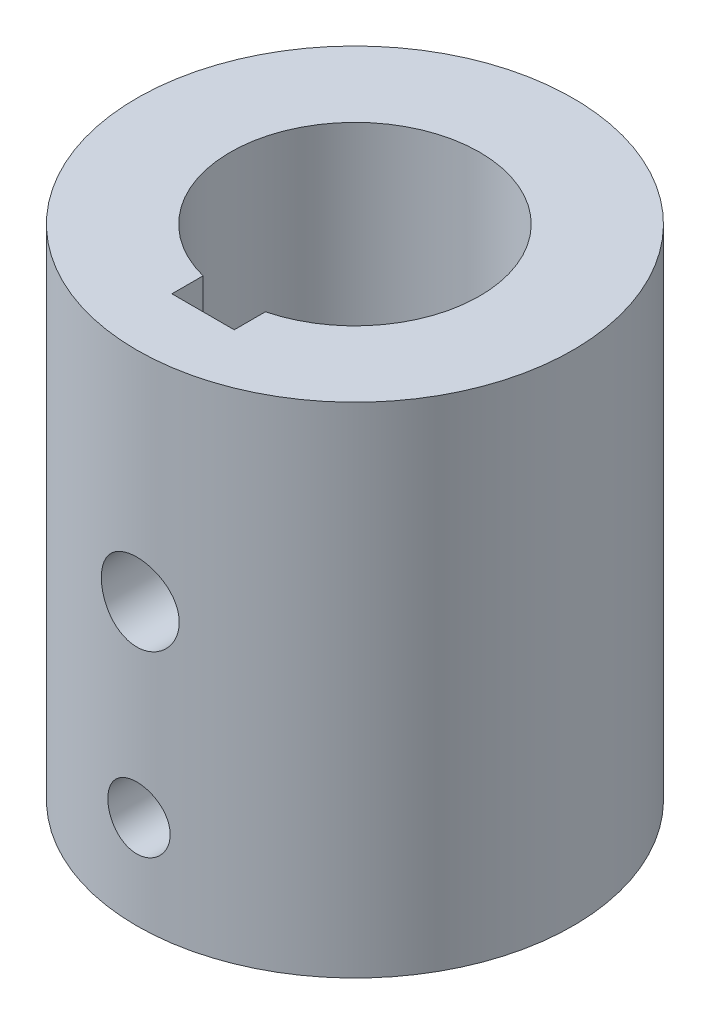
ISO-10303-21;
HEADER;
FILE_DESCRIPTION(('STEP AP214'),'2;1');
FILE_NAME('part.step','',(''),(''),'','','');
FILE_SCHEMA(('AUTOMOTIVE_DESIGN { 1 0 10303 214 1 1 1 1 }'));
ENDSEC;
DATA;
#1=APPLICATION_CONTEXT('core data for automotive mechanical design processes');
#2=APPLICATION_PROTOCOL_DEFINITION('international standard','automotive_design',2000,#1);
#3=PRODUCT_CONTEXT('',#1,'mechanical');
#4=PRODUCT('Part','Part','',(#3));
#5=PRODUCT_RELATED_PRODUCT_CATEGORY('part','',(#4));
#6=PRODUCT_DEFINITION_FORMATION('','',#4);
#7=PRODUCT_DEFINITION_CONTEXT('part definition',#1,'design');
#8=PRODUCT_DEFINITION('design','',#6,#7);
#9=PRODUCT_DEFINITION_SHAPE('','',#8);
#10=(LENGTH_UNIT() NAMED_UNIT(*) SI_UNIT(.MILLI.,.METRE.));
#11=(NAMED_UNIT(*) PLANE_ANGLE_UNIT() SI_UNIT($,.RADIAN.));
#12=(NAMED_UNIT(*) SI_UNIT($,.STERADIAN.) SOLID_ANGLE_UNIT());
#13=UNCERTAINTY_MEASURE_WITH_UNIT(LENGTH_MEASURE(1.E-05),#10,'distance_accuracy_value','');
#14=(GEOMETRIC_REPRESENTATION_CONTEXT(3) GLOBAL_UNCERTAINTY_ASSIGNED_CONTEXT((#13)) GLOBAL_UNIT_ASSIGNED_CONTEXT((#10,
#11,#12)) REPRESENTATION_CONTEXT('',''));
#15=CARTESIAN_POINT('',(0.,0.,0.));
#16=DIRECTION('',(0.,0.,1.));
#17=DIRECTION('',(1.,0.,0.));
#18=AXIS2_PLACEMENT_3D('',#15,#16,#17);
#19=CARTESIAN_POINT('',(0.,50.8,0.));
#20=DIRECTION('',(0.,1.,0.));
#21=DIRECTION('',(0.,0.,1.));
#22=AXIS2_PLACEMENT_3D('',#19,#20,#21);
#23=PLANE('',#22);
#24=DIRECTION('',(0.,0.,-1.));
#25=VECTOR('',#24,1.);
#26=CARTESIAN_POINT('',(3.175,50.8,12.2967221242086));
#27=LINE('',#26,#25);
#28=CARTESIAN_POINT('',(3.175,50.8,15.4717221242085));
#29=VERTEX_POINT('',#28);
#30=CARTESIAN_POINT('',(3.175,50.8,12.2967221242086));
#31=VERTEX_POINT('',#30);
#32=EDGE_CURVE('E106',#29,#31,#27,.T.);
#33=ORIENTED_EDGE('',*,*,#32,.F.);
#34=DIRECTION('',(1.,0.,0.));
#35=VECTOR('',#34,1.);
#36=CARTESIAN_POINT('',(3.175,50.8,15.4717221242085));
#37=LINE('',#36,#35);
#38=CARTESIAN_POINT('',(-3.175,50.8,15.4717221242085));
#39=VERTEX_POINT('',#38);
#40=EDGE_CURVE('E130',#39,#29,#37,.T.);
#41=ORIENTED_EDGE('',*,*,#40,.F.);
#42=DIRECTION('',(0.,0.,1.));
#43=VECTOR('',#42,1.);
#44=CARTESIAN_POINT('',(-3.175,50.8,12.2967221242086));
#45=LINE('',#44,#43);
#46=CARTESIAN_POINT('',(-3.175,50.8,12.2967221242086));
#47=VERTEX_POINT('',#46);
#48=EDGE_CURVE('E117',#47,#39,#45,.T.);
#49=ORIENTED_EDGE('',*,*,#48,.F.);
#50=CARTESIAN_POINT('',(0.,50.8,0.));
#51=DIRECTION('',(0.,1.,0.));
#52=DIRECTION('',(0.,0.,1.));
#53=AXIS2_PLACEMENT_3D('',#50,#51,#52);
#54=CIRCLE('',#53,12.7);
#55=EDGE_CURVE('E125',#31,#47,#54,.T.);
#56=ORIENTED_EDGE('',*,*,#55,.F.);
#57=EDGE_LOOP('',(#33,#41,#49,#56));
#58=FACE_BOUND('',#57,.T.);
#59=CARTESIAN_POINT('',(0.,50.8,0.));
#60=DIRECTION('',(0.,1.,0.));
#61=DIRECTION('',(0.,0.,1.));
#62=AXIS2_PLACEMENT_3D('',#59,#60,#61);
#63=CIRCLE('',#62,22.225);
#64=CARTESIAN_POINT('',(0.,50.8,22.225));
#65=VERTEX_POINT('',#64);
#66=EDGE_CURVE('E138',#65,#65,#63,.T.);
#67=ORIENTED_EDGE('',*,*,#66,.T.);
#68=EDGE_LOOP('',(#67));
#69=FACE_BOUND('',#68,.T.);
#70=ADVANCED_FACE('F34',(#58,#69),#23,.T.);
#71=CARTESIAN_POINT('',(0.,0.,0.));
#72=DIRECTION('',(0.,1.,0.));
#73=DIRECTION('',(0.,0.,1.));
#74=AXIS2_PLACEMENT_3D('',#71,#72,#73);
#75=PLANE('',#74);
#76=CARTESIAN_POINT('',(0.,0.,0.));
#77=DIRECTION('',(0.,1.,0.));
#78=DIRECTION('',(0.,0.,1.));
#79=AXIS2_PLACEMENT_3D('',#76,#77,#78);
#80=CIRCLE('',#79,22.225);
#81=CARTESIAN_POINT('',(0.,0.,22.225));
#82=VERTEX_POINT('',#81);
#83=EDGE_CURVE('E134',#82,#82,#80,.T.);
#84=ORIENTED_EDGE('',*,*,#83,.F.);
#85=EDGE_LOOP('',(#84));
#86=FACE_BOUND('',#85,.T.);
#87=DIRECTION('',(-1.,0.,0.));
#88=VECTOR('',#87,1.);
#89=CARTESIAN_POINT('',(3.175,0.,15.4717221242085));
#90=LINE('',#89,#88);
#91=CARTESIAN_POINT('',(3.175,0.,15.4717221242085));
#92=VERTEX_POINT('',#91);
#93=CARTESIAN_POINT('',(-3.175,0.,15.4717221242085));
#94=VERTEX_POINT('',#93);
#95=EDGE_CURVE('E225',#92,#94,#90,.T.);
#96=ORIENTED_EDGE('',*,*,#95,.F.);
#97=DIRECTION('',(0.,0.,1.));
#98=VECTOR('',#97,1.);
#99=CARTESIAN_POINT('',(3.175,0.,12.2967221242086));
#100=LINE('',#99,#98);
#101=CARTESIAN_POINT('',(3.175,0.,12.2967221242086));
#102=VERTEX_POINT('',#101);
#103=EDGE_CURVE('E226',#102,#92,#100,.T.);
#104=ORIENTED_EDGE('',*,*,#103,.F.);
#105=CARTESIAN_POINT('',(0.,0.,0.));
#106=DIRECTION('',(0.,1.,0.));
#107=DIRECTION('',(0.,0.,1.));
#108=AXIS2_PLACEMENT_3D('',#105,#106,#107);
#109=CIRCLE('',#108,12.7);
#110=CARTESIAN_POINT('',(-3.175,0.,12.2967221242086));
#111=VERTEX_POINT('',#110);
#112=EDGE_CURVE('E135',#102,#111,#109,.T.);
#113=ORIENTED_EDGE('',*,*,#112,.T.);
#114=DIRECTION('',(0.,0.,-1.));
#115=VECTOR('',#114,1.);
#116=CARTESIAN_POINT('',(-3.175,0.,12.2967221242086));
#117=LINE('',#116,#115);
#118=EDGE_CURVE('E228',#94,#111,#117,.T.);
#119=ORIENTED_EDGE('',*,*,#118,.F.);
#120=EDGE_LOOP('',(#96,#104,#113,#119));
#121=FACE_BOUND('',#120,.T.);
#122=ADVANCED_FACE('F211',(#86,#121),#75,.F.);
#123=CARTESIAN_POINT('',(0.,50.8,0.));
#124=DIRECTION('',(0.,-1.,0.));
#125=DIRECTION('',(0.,0.,-1.));
#126=AXIS2_PLACEMENT_3D('',#123,#124,#125);
#127=CYLINDRICAL_SURFACE('',#126,22.225);
#128=CARTESIAN_POINT('',(3.96874999999999,28.575,21.867776485905));
#129=CARTESIAN_POINT('',(3.96874133409612,28.3539888325927,21.8677806526923));
#130=CARTESIAN_POINT('',(3.95022595706882,28.1328629272809,21.8711633805202));
#131=CARTESIAN_POINT('',(3.87669570314424,27.6968326786555,21.8843139592449));
#132=CARTESIAN_POINT('',(3.82164867135281,27.4819339905615,21.8940874351197));
#133=CARTESIAN_POINT('',(3.67678798119663,27.0647308262402,21.9188780868762));
#134=CARTESIAN_POINT('',(3.58700523209759,26.8624153382288,21.9338905996877));
#135=CARTESIAN_POINT('',(3.37530151573146,26.4757358980981,21.9674622811233));
#136=CARTESIAN_POINT('',(3.25338354442912,26.2913702747071,21.9860211190794));
#137=CARTESIAN_POINT('',(2.97940148246222,25.9437236271517,22.0248285849369));
#138=CARTESIAN_POINT('',(2.82704480805626,25.7806748529088,22.0450924124009));
#139=CARTESIAN_POINT('',(2.49714255701685,25.4823110353307,22.0848920530589));
#140=CARTESIAN_POINT('',(2.31959540052913,25.3469977327644,22.1044278204947));
#141=CARTESIAN_POINT('',(1.94283549905543,25.1070638474511,22.1407321830857));
#142=CARTESIAN_POINT('',(1.74348199028281,25.0026610195694,22.1574807982241));
#143=CARTESIAN_POINT('',(1.32971662682326,24.8289131584867,22.1861540356363));
#144=CARTESIAN_POINT('',(1.11530589648431,24.7595655108202,22.1980790176503));
#145=CARTESIAN_POINT('',(0.67991620691011,24.6586113220532,22.2156540318067));
#146=CARTESIAN_POINT('',(0.459030572989993,24.6266137879434,22.2213690275296));
#147=CARTESIAN_POINT('',(0.014957008642684,24.6000509279964,22.2261037439973));
#148=CARTESIAN_POINT('',(-0.208230741880737,24.6054826989671,22.2251239840187));
#149=CARTESIAN_POINT('',(-0.647895244137163,24.6533221597873,22.2166306392229));
#150=CARTESIAN_POINT('',(-0.864419437420148,24.6953089462127,22.2091914326645));
#151=CARTESIAN_POINT('',(-1.28729901147497,24.8144021870584,22.1886982438103));
#152=CARTESIAN_POINT('',(-1.49365404749925,24.8915098312146,22.1756440713057));
#153=CARTESIAN_POINT('',(-1.89157216028556,25.0790646276421,22.1452623389472));
#154=CARTESIAN_POINT('',(-2.08305312427362,25.1896823200555,22.1279130046067));
#155=CARTESIAN_POINT('',(-2.44489309873474,25.4409918518154,22.0908635843617));
#156=CARTESIAN_POINT('',(-2.61525015195887,25.5816864746734,22.071163280958));
#157=CARTESIAN_POINT('',(-2.93249732470517,25.8914822402813,22.0312743412011));
#158=CARTESIAN_POINT('',(-3.07902784611346,26.0609514781925,22.0110827243586));
#159=CARTESIAN_POINT('',(-3.34163648157585,26.4222534929747,21.9727503239844));
#160=CARTESIAN_POINT('',(-3.45771422797378,26.6140865398034,21.9546095652143));
#161=CARTESIAN_POINT('',(-3.65621061729495,27.015120988537,21.922429686102));
#162=CARTESIAN_POINT('',(-3.73858098140972,27.224346789841,21.9083964570697));
#163=CARTESIAN_POINT('',(-3.86690239857902,27.6539734772031,21.8861137315089));
#164=CARTESIAN_POINT('',(-3.91285716714824,27.8743732207321,21.8778636449312));
#165=CARTESIAN_POINT('',(-3.96652616976177,28.3168599515129,21.868196956012));
#166=CARTESIAN_POINT('',(-3.97475525331384,28.538882544533,21.8666883585372));
#167=CARTESIAN_POINT('',(-3.95411581883785,28.9811306600127,21.8704297868041));
#168=CARTESIAN_POINT('',(-3.92524895631911,29.2013562622266,21.8756795109369));
#169=CARTESIAN_POINT('',(-3.83167772312022,29.6320917743511,21.8922606863923));
#170=CARTESIAN_POINT('',(-3.76723977732874,29.8426614578885,21.9035469054858));
#171=CARTESIAN_POINT('',(-3.60463676949826,30.2500146081239,21.9308908830158));
#172=CARTESIAN_POINT('',(-3.50646942568029,30.4467971410426,21.9469489642566));
#173=CARTESIAN_POINT('',(-3.27799596848987,30.8232685007675,21.9822387101283));
#174=CARTESIAN_POINT('',(-3.14736253933815,31.0027556671951,22.001501991259));
#175=CARTESIAN_POINT('',(-2.85810995471772,31.3374472550756,22.0409411759554));
#176=CARTESIAN_POINT('',(-2.69948852676545,31.4926497028003,22.0611171535284));
#177=CARTESIAN_POINT('',(-2.35647125763491,31.7762704496121,22.1004019952987));
#178=CARTESIAN_POINT('',(-2.17178808436835,31.9043437661391,22.1194950865556));
#179=CARTESIAN_POINT('',(-1.78322758299864,32.127644124095,22.1542030997228));
#180=CARTESIAN_POINT('',(-1.57935094420751,32.2228723445468,22.1698181464755));
#181=CARTESIAN_POINT('',(-1.1591755904646,32.3772538232099,22.1957425268997));
#182=CARTESIAN_POINT('',(-0.942942569632173,32.4365813938184,22.2060774589432));
#183=CARTESIAN_POINT('',(-0.503380919967973,32.5180361250246,22.2203859201495));
#184=CARTESIAN_POINT('',(-0.280052967444973,32.5401668205563,22.2243600537969));
#185=CARTESIAN_POINT('',(0.164041406377081,32.5464859402782,22.225488659181));
#186=CARTESIAN_POINT('',(0.384800323064926,32.5311970836785,22.2227370840321));
#187=CARTESIAN_POINT('',(0.820551057737983,32.4642496403022,22.2109171439356));
#188=CARTESIAN_POINT('',(1.03554292031014,32.4125913347936,22.2018488278395));
#189=CARTESIAN_POINT('',(1.45341418977593,32.2745831250585,22.1784124656814));
#190=CARTESIAN_POINT('',(1.6563108105391,32.1882839441572,22.1640521709721));
#191=CARTESIAN_POINT('',(2.04482367238512,31.9835042746871,22.1315921246134));
#192=CARTESIAN_POINT('',(2.2304389016075,31.8650219033165,22.113492154198));
#193=CARTESIAN_POINT('',(2.58173772091082,31.5974158679185,22.0752559908291));
#194=CARTESIAN_POINT('',(2.74712932341881,31.4479122138621,22.0550962906701));
#195=CARTESIAN_POINT('',(3.05065987047593,31.1233004470071,22.015167385571));
#196=CARTESIAN_POINT('',(3.18879241412801,30.9481863371995,21.995398273326));
#197=CARTESIAN_POINT('',(3.4349471308505,30.5755974066207,21.958311197813));
#198=CARTESIAN_POINT('',(3.54271094727944,30.3779497014664,21.941014848746));
#199=CARTESIAN_POINT('',(3.72333658010777,29.9671183300967,21.9110894700011));
#200=CARTESIAN_POINT('',(3.79623219722139,29.7539499413751,21.8984559229974));
#201=CARTESIAN_POINT('',(3.88978455565133,29.3792168078487,21.8819955129252));
#202=CARTESIAN_POINT('',(3.91934730292148,29.2198808128656,21.8766941381956));
#203=CARTESIAN_POINT('',(3.95883297382862,28.898717027876,21.8695831386379));
#204=CARTESIAN_POINT('',(3.96875634772027,28.7368892950812,21.8677734337594));
#205=CARTESIAN_POINT('',(3.96874999999999,28.575,21.867776485905));
#206=B_SPLINE_CURVE_WITH_KNOTS('',3,(#128,#129,#130,#131,#132,#133,#134,#135,#136,#137,#138,
#139,#140,#141,#142,#143,#144,#145,#146,#147,#148,#149,#150,#151,#152,#153,#154,#155,#156,#157,
#158,#159,#160,#161,#162,#163,#164,#165,#166,#167,#168,#169,#170,#171,#172,#173,#174,#175,#176,
#177,#178,#179,#180,#181,#182,#183,#184,#185,#186,#187,#188,#189,#190,#191,#192,#193,#194,#195,
#196,#197,#198,#199,#200,#201,#202,#203,#204,#205),.UNSPECIFIED.,.T.,.F.,(4,2,2,2,2,2,2,2,2,2,2,
2,2,2,2,2,2,2,2,2,2,2,2,2,2,2,2,2,2,2,2,2,2,2,2,2,2,2,4),(0.,0.662441264664795,1.32546637997232,
1.98790286030462,2.65027760355653,3.3193553678834,3.98847511286744,4.66220218306646,
5.33587899831951,6.00243844124996,6.6689461832899,7.32787959444333,7.98683532894338,
8.64920264122188,9.31163127976387,9.98327925589565,10.6549353404561,11.3275500935422,
12.000096210324,12.6634360936198,13.3267463745643,13.9851546238275,14.6436074228922,
15.3089889001368,15.9744244278651,16.6478718650897,17.3212951254165,17.9914218404763,
18.6614848677216,19.3222412439943,19.9829925102738,20.6427797723399,21.302605642023,
21.9710494011055,22.6396499360239,23.3137776630943,23.9872505697086,24.4724957695729,
24.9577298445175),.UNSPECIFIED.);
#207=CARTESIAN_POINT('',(3.96874999999999,28.575,21.867776485905));
#208=VERTEX_POINT('',#207);
#209=EDGE_CURVE('E159',#208,#208,#206,.T.);
#210=ORIENTED_EDGE('',*,*,#209,.T.);
#211=EDGE_LOOP('',(#210));
#212=FACE_BOUND('',#211,.T.);
#213=CARTESIAN_POINT('',(0.,12.7,-22.225));
#214=CARTESIAN_POINT('',(-0.177372532942854,12.6999926130805,-22.2249972543515));
#215=CARTESIAN_POINT('',(-0.354850399948266,12.6850863672689,-22.2228543413594));
#216=CARTESIAN_POINT('',(-0.704852096668657,12.6258664924571,-22.2145120385616));
#217=CARTESIAN_POINT('',(-0.877370818068793,12.581523599379,-22.2083086121327));
#218=CARTESIAN_POINT('',(-1.21233779879378,12.4647767539938,-22.1925429326379));
#219=CARTESIAN_POINT('',(-1.37479331768552,12.3923933100758,-22.1829831348434));
#220=CARTESIAN_POINT('',(-1.68522538951301,12.2216686513072,-22.1615631533086));
#221=CARTESIAN_POINT('',(-1.83320409151771,12.1233312973276,-22.1497033117895));
#222=CARTESIAN_POINT('',(-2.11156121501147,11.9027442565439,-22.1249093670883));
#223=CARTESIAN_POINT('',(-2.24182175079206,11.7803465089261,-22.1119689131174));
#224=CARTESIAN_POINT('',(-2.48002835136539,11.5154315838366,-22.0865223693237));
#225=CARTESIAN_POINT('',(-2.58797317910011,11.372913291731,-22.0740163036128));
#226=CARTESIAN_POINT('',(-2.77893740764057,11.0710182565293,-22.0507927185792));
#227=CARTESIAN_POINT('',(-2.86184379837958,10.9115693430446,-22.0400834025882));
#228=CARTESIAN_POINT('',(-2.99965570904621,10.5808318371159,-22.0217518243371));
#229=CARTESIAN_POINT('',(-3.05456261243032,10.4095438301172,-22.0141294095569));
#230=CARTESIAN_POINT('',(-3.13445309119421,10.061225718796,-22.0028966652068));
#231=CARTESIAN_POINT('',(-3.15963772607625,9.88424261422916,-21.9992593898744));
#232=CARTESIAN_POINT('',(-3.1799914177403,9.52852772524451,-21.9963267795921));
#233=CARTESIAN_POINT('',(-3.17516204015659,9.34979603252471,-21.9970312181636));
#234=CARTESIAN_POINT('',(-3.13578932460962,8.9970719685675,-22.0026777932302));
#235=CARTESIAN_POINT('',(-3.10146916470387,8.82305410250443,-22.0075880999923));
#236=CARTESIAN_POINT('',(-3.00443812120536,8.48327270104747,-22.0210434511419));
#237=CARTESIAN_POINT('',(-2.94172650310753,8.31750937932705,-22.0295885895644));
#238=CARTESIAN_POINT('',(-2.78945822996728,7.99825910788075,-22.0493862330951));
#239=CARTESIAN_POINT('',(-2.69980630064438,7.84481821817508,-22.0606483183298));
#240=CARTESIAN_POINT('',(-2.4962702351622,7.55507375129897,-22.0846038460095));
#241=CARTESIAN_POINT('',(-2.38238465455236,7.41877119643244,-22.0972973737546));
#242=CARTESIAN_POINT('',(-2.13238543141818,7.16587847011105,-22.1228264578543));
#243=CARTESIAN_POINT('',(-1.99607975680891,7.04947807443464,-22.1356622590839));
#244=CARTESIAN_POINT('',(-1.70576608109782,6.84117725861614,-22.1599225931851));
#245=CARTESIAN_POINT('',(-1.55175801494515,6.7492769285084,-22.1713471208704));
#246=CARTESIAN_POINT('',(-1.23025230140896,6.59257813593975,-22.1915080462026));
#247=CARTESIAN_POINT('',(-1.06274783555436,6.52779347617785,-22.2002430742161));
#248=CARTESIAN_POINT('',(-0.719084634272286,6.42732563490981,-22.2140291032861));
#249=CARTESIAN_POINT('',(-0.542926429752161,6.39164067049386,-22.2190803300435));
#250=CARTESIAN_POINT('',(-0.18859503554404,6.35063559242257,-22.2248999013422));
#251=CARTESIAN_POINT('',(-0.0104526390235474,6.34505441923126,-22.2257050662886));
#252=CARTESIAN_POINT('',(0.344225324872354,6.36372363273189,-22.2230417753747));
#253=CARTESIAN_POINT('',(0.52076093710199,6.38797318409458,-22.2195734391824));
#254=CARTESIAN_POINT('',(0.866429588550372,6.46539845728161,-22.2087756505003));
#255=CARTESIAN_POINT('',(1.03559150406069,6.51844781394755,-22.2014630698402));
#256=CARTESIAN_POINT('',(1.36261942363918,6.65183413613148,-22.1837944415749));
#257=CARTESIAN_POINT('',(1.52048494016621,6.73217227854688,-22.1734382627095));
#258=CARTESIAN_POINT('',(1.8215922670791,6.91847393446759,-22.1507427375886));
#259=CARTESIAN_POINT('',(1.96473002515803,7.02460404465741,-22.1383906807312));
#260=CARTESIAN_POINT('',(2.23125553050272,7.25924392073296,-22.1131200870885));
#261=CARTESIAN_POINT('',(2.35464224123725,7.38775486042191,-22.1002015206183));
#262=CARTESIAN_POINT('',(2.57910591335467,7.66466701278108,-22.0751380976941));
#263=CARTESIAN_POINT('',(2.6800084525968,7.81321029160208,-22.0629997770826));
#264=CARTESIAN_POINT('',(2.85542940396839,8.12529043373384,-22.0409844847579));
#265=CARTESIAN_POINT('',(2.92994847564319,8.28882692210919,-22.0311074565181));
#266=CARTESIAN_POINT('',(3.05021314579171,8.62571824590374,-22.0147796029054));
#267=CARTESIAN_POINT('',(3.09605251584503,8.79903904216058,-22.0083176225203));
#268=CARTESIAN_POINT('',(3.15795617455243,9.15101764067578,-21.9995211720729));
#269=CARTESIAN_POINT('',(3.17402231261418,9.32967511073832,-21.9971864456406));
#270=CARTESIAN_POINT('',(3.17588249719059,9.68551819960255,-21.9969178067031));
#271=CARTESIAN_POINT('',(3.16195070821392,9.86270241650281,-21.9989440373804));
#272=CARTESIAN_POINT('',(3.10479592163145,10.2121813219428,-22.0070826718652));
#273=CARTESIAN_POINT('',(3.06157295420644,10.3844760155204,-22.0131950714623));
#274=CARTESIAN_POINT('',(2.94715637335701,10.719221108364,-22.0288038829555));
#275=CARTESIAN_POINT('',(2.8759801345313,10.8816775504238,-22.0382981924558));
#276=CARTESIAN_POINT('',(2.70770451922401,11.1923868813635,-22.0596038634222));
#277=CARTESIAN_POINT('',(2.61060443067045,11.3406393799398,-22.0714152885321));
#278=CARTESIAN_POINT('',(2.39223466597663,11.6201282369146,-22.0961531446146));
#279=CARTESIAN_POINT('',(2.27076147542829,11.7512048205086,-22.1090884059355));
#280=CARTESIAN_POINT('',(2.00752315239733,11.9912125355487,-22.1345414251083));
#281=CARTESIAN_POINT('',(1.86575329213172,12.1001384930142,-22.1470590848466));
#282=CARTESIAN_POINT('',(1.56512168644748,12.2932310206074,-22.1703370170694));
#283=CARTESIAN_POINT('',(1.4061784764587,12.3772718134757,-22.1810882437725));
#284=CARTESIAN_POINT('',(1.07635879528743,12.5173418436097,-22.1995326276888));
#285=CARTESIAN_POINT('',(0.905495085753382,12.5734005285239,-22.2072289979989));
#286=CARTESIAN_POINT('',(0.611523040346122,12.6429826942238,-22.2169095127051));
#287=CARTESIAN_POINT('',(0.490242064945984,12.6643321086395,-22.2199281098463));
#288=CARTESIAN_POINT('',(0.245990937667989,12.6928432469275,-22.2239742949424));
#289=CARTESIAN_POINT('',(0.12302080396911,12.7000051233681,-22.2250019043077));
#290=CARTESIAN_POINT('',(0.,12.7,-22.225));
#291=B_SPLINE_CURVE_WITH_KNOTS('',3,(#213,#214,#215,#216,#217,#218,#219,#220,#221,#222,#223,
#224,#225,#226,#227,#228,#229,#230,#231,#232,#233,#234,#235,#236,#237,#238,#239,#240,#241,#242,
#243,#244,#245,#246,#247,#248,#249,#250,#251,#252,#253,#254,#255,#256,#257,#258,#259,#260,#261,
#262,#263,#264,#265,#266,#267,#268,#269,#270,#271,#272,#273,#274,#275,#276,#277,#278,#279,#280,
#281,#282,#283,#284,#285,#286,#287,#288,#289,#290),.UNSPECIFIED.,.T.,.F.,(4,2,2,2,2,2,2,2,2,2,2,
2,2,2,2,2,2,2,2,2,2,2,2,2,2,2,2,2,2,2,2,2,2,2,2,2,2,2,4),(0.,0.531668122197692,1.06386558878678,
1.5956745477125,2.12740443995392,2.66251510386461,3.19765542336743,3.73517617335121,
4.2726703618259,4.80650738344102,5.34031655851174,5.87012123820307,6.39993962506167,
6.93165421549765,7.463400507747,7.99996426271881,8.5365299894608,9.07336851324163,
9.61017414298082,10.1423170293666,10.6744450148604,11.2042568290739,11.7340914956542,
12.2674439687877,12.8008244229882,13.3382087300045,13.8755796023068,14.411184168761,
14.9467554642422,15.477452723073,16.0081494350893,16.5385168086807,17.0688987518139,
17.6039089042129,18.1390438820047,18.6768391543641,19.2140672653074,19.5828218978377,
19.9515725648791),.UNSPECIFIED.);
#292=CARTESIAN_POINT('',(0.,12.7,-22.225));
#293=VERTEX_POINT('',#292);
#294=EDGE_CURVE('E141',#293,#293,#291,.T.);
#295=ORIENTED_EDGE('',*,*,#294,.T.);
#296=EDGE_LOOP('',(#295));
#297=FACE_BOUND('',#296,.T.);
#298=CARTESIAN_POINT('',(3.175,9.525,21.9970452561247));
#299=CARTESIAN_POINT('',(3.17499260409125,9.34763787815582,21.9970481082156));
#300=CARTESIAN_POINT('',(3.16008804904672,9.1701703934739,21.9992135575726));
#301=CARTESIAN_POINT('',(3.10087549968881,8.82019026467832,22.0076363111921));
#302=CARTESIAN_POINT('',(3.05653820399453,8.64768273711978,22.0138976930162));
#303=CARTESIAN_POINT('',(2.93980772902895,8.31273943870411,22.0297889769634));
#304=CARTESIAN_POINT('',(2.86743532306302,8.15029631351541,22.0394163844335));
#305=CARTESIAN_POINT('',(2.69673666724122,7.83988505446948,22.0609519822444));
#306=CARTESIAN_POINT('',(2.598414251674,7.69191478657354,22.0728598355627));
#307=CARTESIAN_POINT('',(2.37784238108812,7.41354833034236,22.097711475932));
#308=CARTESIAN_POINT('',(2.25544152078385,7.28327265423791,22.1106614947546));
#309=CARTESIAN_POINT('',(1.99051398786035,7.04503677788058,22.1360825870052));
#310=CARTESIAN_POINT('',(1.84798624218866,6.93707776818357,22.1485536348521));
#311=CARTESIAN_POINT('',(1.54608273463253,6.7460985573065,22.1716764627384));
#312=CARTESIAN_POINT('',(1.38663642886805,6.66318880320199,22.1823200989089));
#313=CARTESIAN_POINT('',(1.05590458421642,6.52536995766708,22.2005199793149));
#314=CARTESIAN_POINT('',(0.884619614487436,6.47045952119726,22.2080763718529));
#315=CARTESIAN_POINT('',(0.536311575871261,6.39056188394422,22.2192064188926));
#316=CARTESIAN_POINT('',(0.359335586048433,6.3653732389286,22.2228068738));
#317=CARTESIAN_POINT('',(0.00363468487945935,6.34500906102552,22.2257111283058));
#318=CARTESIAN_POINT('',(-0.175090137405668,6.3498320076288,22.2250151455792));
#319=CARTESIAN_POINT('',(-0.527842150095068,6.3891943879176,22.2194264377293));
#320=CARTESIAN_POINT('',(-0.701894074636517,6.42351712322599,22.2145643168523));
#321=CARTESIAN_POINT('',(-1.0417422572668,6.52056506352249,22.2012237809256));
#322=CARTESIAN_POINT('',(-1.20753831907824,6.58329094341813,22.1927452799447));
#323=CARTESIAN_POINT('',(-1.52682887224378,6.73558905734392,22.1730719283893));
#324=CARTESIAN_POINT('',(-1.68027888605582,6.82525328990116,22.1618677947259));
#325=CARTESIAN_POINT('',(-1.97003641446851,7.02881578222517,22.1379933588026));
#326=CARTESIAN_POINT('',(-2.10634290346628,7.14271549077111,22.1253229689117));
#327=CARTESIAN_POINT('',(-2.35922024831388,7.39272493016064,22.0997971284829));
#328=CARTESIAN_POINT('',(-2.47560416314842,7.52902376073934,22.0869410354408));
#329=CARTESIAN_POINT('',(-2.68387495974321,7.81931780276931,22.0626034152762));
#330=CARTESIAN_POINT('',(-2.77576171599433,7.97331310488116,22.0511218951963));
#331=CARTESIAN_POINT('',(-2.93245066164262,8.29481496022606,22.0308337272164));
#332=CARTESIAN_POINT('',(-2.99723492899698,8.46233036683863,22.0220288503466));
#333=CARTESIAN_POINT('',(-3.09769865136959,8.8060174079736,22.0081231447171));
#334=CARTESIAN_POINT('',(-3.1333799581498,8.9821884909966,22.0030220802935));
#335=CARTESIAN_POINT('',(-3.17437120217508,9.33652650317019,21.9971458195224));
#336=CARTESIAN_POINT('',(-3.17994555628349,9.51466224126799,21.9963329630993));
#337=CARTESIAN_POINT('',(-3.16126508092304,9.86932526547743,21.9990252889568));
#338=CARTESIAN_POINT('',(-3.1370110882235,10.0458525965695,22.0025303501077));
#339=CARTESIAN_POINT('',(-3.05958617595132,10.3914768357952,22.013429057337));
#340=CARTESIAN_POINT('',(-3.00654586403018,10.5606036042162,22.0208051351058));
#341=CARTESIAN_POINT('',(-2.87318936047198,10.8875652159622,22.0386003729932));
#342=CARTESIAN_POINT('',(-2.79287193790099,11.0453995493042,22.0490196704401));
#343=CARTESIAN_POINT('',(-2.60660134525821,11.3464846090579,22.071816543563));
#344=CARTESIAN_POINT('',(-2.50047633043061,11.4896280259246,22.0842070451803));
#345=CARTESIAN_POINT('',(-2.26584316041416,11.7561673112555,22.1095108174966));
#346=CARTESIAN_POINT('',(-2.13733386064594,11.8795621692939,22.1224241149018));
#347=CARTESIAN_POINT('',(-1.860418374478,12.1040449092637,22.1474355820708));
#348=CARTESIAN_POINT('',(-1.71186978574737,12.2049580041822,22.1595268892944));
#349=CARTESIAN_POINT('',(-1.39977606882427,12.380397456478,22.1814266422619));
#350=CARTESIAN_POINT('',(-1.23623131940512,12.454924480084,22.1912351456427));
#351=CARTESIAN_POINT('',(-0.899344030292868,12.5751941064762,22.2074339607805));
#352=CARTESIAN_POINT('',(-0.726036773609239,12.6210339219461,22.2138358055584));
#353=CARTESIAN_POINT('',(-0.374086848735183,12.6829430540317,22.2225482509749));
#354=CARTESIAN_POINT('',(-0.195444499436413,12.699014146393,22.224859095647));
#355=CARTESIAN_POINT('',(0.160405969870607,12.7008893793244,22.2251271217915));
#356=CARTESIAN_POINT('',(0.337612707029037,12.6869615751918,22.22312286098));
#357=CARTESIAN_POINT('',(0.687137680649308,12.6298068618067,22.2150632703669));
#358=CARTESIAN_POINT('',(0.859455928651813,12.5865800217288,22.2090079501298));
#359=CARTESIAN_POINT('',(1.19425039676433,12.4721461608328,22.1935234001093));
#360=CARTESIAN_POINT('',(1.3567324754534,12.4009559884809,22.1840962022546));
#361=CARTESIAN_POINT('',(1.66748730803941,12.2326445256414,22.1629058916315));
#362=CARTESIAN_POINT('',(1.81575968757259,12.1355225522188,22.1511427173455));
#363=CARTESIAN_POINT('',(2.09524909499351,11.9171280020843,22.1264646284537));
#364=CARTESIAN_POINT('',(2.22631026403017,11.7956569604088,22.1135407654047));
#365=CARTESIAN_POINT('',(2.46628787804759,11.5324293731211,22.0880657969985));
#366=CARTESIAN_POINT('',(2.57519910777256,11.3906680634729,22.0755147800215));
#367=CARTESIAN_POINT('',(2.76827493516725,11.0900441166593,22.052138519243));
#368=CARTESIAN_POINT('',(2.8523113244952,10.9310984540416,22.0413223436744));
#369=CARTESIAN_POINT('',(2.99237245226717,10.6012737292099,22.0227465951902));
#370=CARTESIAN_POINT('',(3.04842668700633,10.4304074501893,22.014983805506));
#371=CARTESIAN_POINT('',(3.11799692575809,10.1364471739847,22.0052152641794));
#372=CARTESIAN_POINT('',(3.13934098015756,10.0151813675332,22.0021674508921));
#373=CARTESIAN_POINT('',(3.16784500269689,9.77096058731926,21.9980814690859));
#374=CARTESIAN_POINT('',(3.17500512927125,9.64800563244007,21.9970432781193));
#375=CARTESIAN_POINT('',(3.175,9.525,21.9970452561247));
#376=B_SPLINE_CURVE_WITH_KNOTS('',3,(#298,#299,#300,#301,#302,#303,#304,#305,#306,#307,#308,
#309,#310,#311,#312,#313,#314,#315,#316,#317,#318,#319,#320,#321,#322,#323,#324,#325,#326,#327,
#328,#329,#330,#331,#332,#333,#334,#335,#336,#337,#338,#339,#340,#341,#342,#343,#344,#345,#346,
#347,#348,#349,#350,#351,#352,#353,#354,#355,#356,#357,#358,#359,#360,#361,#362,#363,#364,#365,
#366,#367,#368,#369,#370,#371,#372,#373,#374,#375),.UNSPECIFIED.,.T.,.F.,(4,2,2,2,2,2,2,2,2,2,2,
2,2,2,2,2,2,2,2,2,2,2,2,2,2,2,2,2,2,2,2,2,2,2,2,2,2,2,4),(0.,0.531636842186744,1.06380374381047,
1.59557707521232,2.12727187746938,2.66242348592818,3.19760363644328,3.73511017448155,
4.27259088918994,4.80640742645055,5.34019691861482,5.87009851040563,6.40001269422942,
6.93175759380701,7.463534289644,8.0000557230316,8.53657990518865,9.07345831563073,
9.61030256293014,10.1424241696856,10.6745308492685,11.2042432252682,11.7339795087709,
12.267344671057,12.8007371140035,13.3381420041644,13.8755333242788,14.4110935764552,
14.9466218806916,15.477384832952,16.0081465320919,16.5385889260441,17.0690452910066,
17.604015295275,18.1391111140454,18.6769186963043,19.2141581662606,19.5828674249722,
19.9515725651772),.UNSPECIFIED.);
#377=CARTESIAN_POINT('',(3.175,9.525,21.9970452561247));
#378=VERTEX_POINT('',#377);
#379=EDGE_CURVE('E158',#378,#378,#376,.T.);
#380=ORIENTED_EDGE('',*,*,#379,.T.);
#381=EDGE_LOOP('',(#380));
#382=FACE_BOUND('',#381,.T.);
#383=ORIENTED_EDGE('',*,*,#66,.F.);
#384=EDGE_LOOP('',(#383));
#385=FACE_BOUND('',#384,.T.);
#386=ORIENTED_EDGE('',*,*,#83,.T.);
#387=EDGE_LOOP('',(#386));
#388=FACE_BOUND('',#387,.T.);
#389=ADVANCED_FACE('F36',(#212,#297,#382,#385,#388),#127,.T.);
#390=CARTESIAN_POINT('',(0.,50.8,0.));
#391=DIRECTION('',(0.,-1.,0.));
#392=DIRECTION('',(0.,0.,-1.));
#393=AXIS2_PLACEMENT_3D('',#390,#391,#392);
#394=CYLINDRICAL_SURFACE('',#393,12.7);
#395=DIRECTION('',(0.,1.,0.));
#396=VECTOR('',#395,1.);
#397=CARTESIAN_POINT('',(3.175,-7.09951582856183,12.2967221242086));
#398=LINE('',#397,#396);
#399=CARTESIAN_POINT('',(3.175,30.95625,12.2967221242086));
#400=VERTEX_POINT('',#399);
#401=EDGE_CURVE('E109',#400,#31,#398,.T.);
#402=ORIENTED_EDGE('',*,*,#401,.T.);
#403=ORIENTED_EDGE('',*,*,#55,.T.);
#404=DIRECTION('',(0.,1.,0.));
#405=VECTOR('',#404,1.);
#406=CARTESIAN_POINT('',(-3.175,-7.09951582856183,12.2967221242086));
#407=LINE('',#406,#405);
#408=CARTESIAN_POINT('',(-3.175,30.95625,12.2967221242086));
#409=VERTEX_POINT('',#408);
#410=EDGE_CURVE('E244',#409,#47,#407,.T.);
#411=ORIENTED_EDGE('',*,*,#410,.F.);
#412=CARTESIAN_POINT('',(3.96874999999999,28.575,12.0639555468967));
#413=CARTESIAN_POINT('',(3.96874853251649,28.3579981603529,12.0639568842915));
#414=CARTESIAN_POINT('',(3.95089185662995,28.1409814093673,12.0698746252851));
#415=CARTESIAN_POINT('',(3.88014131899212,27.713323539213,12.0928015382143));
#416=CARTESIAN_POINT('',(3.82723798884485,27.5026841590754,12.1098137074621));
#417=CARTESIAN_POINT('',(3.68839077609799,27.0940374363659,12.1528185580417));
#418=CARTESIAN_POINT('',(3.60250535963948,26.8960084598895,12.1787953399196));
#419=CARTESIAN_POINT('',(3.40032702499772,26.5171151906318,12.2367803974434));
#420=CARTESIAN_POINT('',(3.2840287350038,26.3362539378766,12.2687897383379));
#421=CARTESIAN_POINT('',(3.02004752422577,25.9906170957082,12.3364665534787));
#422=CARTESIAN_POINT('',(2.87149984411226,25.8265180400408,12.3722169174668));
#423=CARTESIAN_POINT('',(2.54908699749619,25.5251076580608,12.4426423060657));
#424=CARTESIAN_POINT('',(2.37521830174644,25.3878000722001,12.4773171799559));
#425=CARTESIAN_POINT('',(2.00223727216642,25.1408848749393,12.542632820135));
#426=CARTESIAN_POINT('',(1.8026429419513,25.0319739903351,12.5731646098683));
#427=CARTESIAN_POINT('',(1.38685343930956,24.8495310417086,12.6257860206983));
#428=CARTESIAN_POINT('',(1.17066218269639,24.7759906620751,12.6478776258325));
#429=CARTESIAN_POINT('',(0.734899333367361,24.6686351682918,12.6805428323124));
#430=CARTESIAN_POINT('',(0.515638146611587,24.6336637444236,12.6914509627465));
#431=CARTESIAN_POINT('',(0.0741070844008519,24.6007752000609,12.7017016690635));
#432=CARTESIAN_POINT('',(-0.148162095639547,24.6028496564107,12.7010468740197));
#433=CARTESIAN_POINT('',(-0.581261475126269,24.6432333257854,12.6884784372079));
#434=CARTESIAN_POINT('',(-0.792221663947051,24.6802890426538,12.6769542933654));
#435=CARTESIAN_POINT('',(-1.2047634761292,24.7875265933866,12.6444210713078));
#436=CARTESIAN_POINT('',(-1.40634448690292,24.85771058765,12.6234113745139));
#437=CARTESIAN_POINT('',(-1.79729797751629,25.0300178503125,12.5737448464102));
#438=CARTESIAN_POINT('',(-1.986490837852,25.1325215171867,12.5449975673293));
#439=CARTESIAN_POINT('',(-2.34538047290817,25.3662532415629,12.4828847037847));
#440=CARTESIAN_POINT('',(-2.51507230096487,25.4974885627659,12.4495179522495));
#441=CARTESIAN_POINT('',(-2.83761719258917,25.7913937904907,12.3800765457896));
#442=CARTESIAN_POINT('',(-2.98947379336681,25.9551457935578,12.3439469905188));
#443=CARTESIAN_POINT('',(-3.26386743274751,26.3061294483057,12.2742520403678));
#444=CARTESIAN_POINT('',(-3.38640101789398,26.4933638616244,12.2406869478284));
#445=CARTESIAN_POINT('',(-3.59982976435592,26.888812963591,12.1796443805944));
#446=CARTESIAN_POINT('',(-3.69035586221749,27.0972388235463,12.1522391668376));
#447=CARTESIAN_POINT('',(-3.83471248377107,27.5274388865984,12.1074670626035));
#448=CARTESIAN_POINT('',(-3.88855619178879,27.7492082625671,12.090096565806));
#449=CARTESIAN_POINT('',(-3.95609715466835,28.1902533494324,12.0681611381736));
#450=CARTESIAN_POINT('',(-3.97132030073622,28.4092713380465,12.0631098080018));
#451=CARTESIAN_POINT('',(-3.96547163781533,28.8467474292471,12.0650342093526));
#452=CARTESIAN_POINT('',(-3.94440543703715,29.0652056131214,12.0720080824823));
#453=CARTESIAN_POINT('',(-3.86793973404381,29.4887913418714,12.0967169001143));
#454=CARTESIAN_POINT('',(-3.81355063934747,29.6941216951856,12.1141348427389));
#455=CARTESIAN_POINT('',(-3.67316936373721,30.0927191895868,12.1574333727714));
#456=CARTESIAN_POINT('',(-3.58717202843404,30.2859843571746,12.1833153403409));
#457=CARTESIAN_POINT('',(-3.38320096332413,30.6610991735255,12.2415471339902));
#458=CARTESIAN_POINT('',(-3.26438093276172,30.8424624945071,12.2740611607997));
#459=CARTESIAN_POINT('',(-2.99912534755836,31.183231849699,12.3415535798866));
#460=CARTESIAN_POINT('',(-2.85268261914322,31.3426321613379,12.3765326108584));
#461=CARTESIAN_POINT('',(-2.5291191091177,31.6417654117732,12.4467679551153));
#462=CARTESIAN_POINT('',(-2.35097843807855,31.7804094709941,12.4819756800704));
#463=CARTESIAN_POINT('',(-1.97310865744318,32.025879062545,12.5472526500367));
#464=CARTESIAN_POINT('',(-1.77338053726987,32.1327060523125,12.5773221303875));
#465=CARTESIAN_POINT('',(-1.35923503657857,32.3104845358476,12.6287629037303));
#466=CARTESIAN_POINT('',(-1.14493733510093,32.3816957389037,12.6501969360681));
#467=CARTESIAN_POINT('',(-0.706619281629037,32.4868303100223,12.6822277040923));
#468=CARTESIAN_POINT('',(-0.482601994980632,32.5207653465901,12.6928278310283));
#469=CARTESIAN_POINT('',(-0.0412271738602537,32.549436430555,12.7017717580917));
#470=CARTESIAN_POINT('',(0.176019434430208,32.5457453292922,12.7006073586846));
#471=CARTESIAN_POINT('',(0.606657479606312,32.5030724999204,12.6873310540733));
#472=CARTESIAN_POINT('',(0.820049166920127,32.4640930727256,12.6752198626357));
#473=CARTESIAN_POINT('',(1.23429750117651,32.3529515207193,12.6415663743223));
#474=CARTESIAN_POINT('',(1.4352775410771,32.2812104950909,12.6201439227365));
#475=CARTESIAN_POINT('',(1.82244500096278,32.1069626236131,12.5700772724174));
#476=CARTESIAN_POINT('',(2.00862987679647,32.0044505008344,12.5414318351506));
#477=CARTESIAN_POINT('',(2.36779338152876,31.7675489922564,12.4786992260472));
#478=CARTESIAN_POINT('',(2.54010987739362,31.6321963161769,12.444460434593));
#479=CARTESIAN_POINT('',(2.86010601269283,31.335154851017,12.3748398853692));
#480=CARTESIAN_POINT('',(3.0077782538757,31.1734581821074,12.3394577881682));
#481=CARTESIAN_POINT('',(3.27923099268226,30.8218975895045,12.2701650893337));
#482=CARTESIAN_POINT('',(3.40205783883207,30.6312779451049,12.2363420774147));
#483=CARTESIAN_POINT('',(3.61379994626555,30.2310859681455,12.1754939776251));
#484=CARTESIAN_POINT('',(3.70272892306257,30.0215213435205,12.148466141849));
#485=CARTESIAN_POINT('',(3.8376599788364,29.6077556900259,12.1064832939804));
#486=CARTESIAN_POINT('',(3.88667433985247,29.4046194118413,12.090695752639));
#487=CARTESIAN_POINT('',(3.95221605466116,28.9926590830936,12.0694325058162));
#488=CARTESIAN_POINT('',(3.96875141226471,28.7838364466852,12.0639542598257));
#489=CARTESIAN_POINT('',(3.96874999999999,28.575,12.0639555468967));
#490=B_SPLINE_CURVE_WITH_KNOTS('',3,(#412,#413,#414,#415,#416,#417,#418,#419,#420,#421,#422,
#423,#424,#425,#426,#427,#428,#429,#430,#431,#432,#433,#434,#435,#436,#437,#438,#439,#440,#441,
#442,#443,#444,#445,#446,#447,#448,#449,#450,#451,#452,#453,#454,#455,#456,#457,#458,#459,#460,
#461,#462,#463,#464,#465,#466,#467,#468,#469,#470,#471,#472,#473,#474,#475,#476,#477,#478,#479,
#480,#481,#482,#483,#484,#485,#486,#487,#488,#489),.UNSPECIFIED.,.T.,.F.,(4,2,2,2,2,2,2,2,2,2,2,
2,2,2,2,2,2,2,2,2,2,2,2,2,2,2,2,2,2,2,2,2,2,2,2,2,2,2,4),(0.,0.65023408671646,1.30064391591466,
1.9499060700765,2.59928298063671,3.26888730748911,3.93858505338064,4.62342934734852,
5.30811255551901,5.97165820002818,6.63505297547883,7.27554370928957,7.91607621728544,
8.56444834631697,9.21298458114369,9.88854826126034,10.5641914653574,11.2473889522044,
11.9303407555771,12.5858566319691,13.2412712130333,13.8777336124857,14.5142998466166,
15.1691217226573,15.8241138944544,16.5062515255927,17.1883579053947,17.8654150975664,
18.5422602910407,19.1909319775321,19.8395613715579,20.4800786269208,21.1207057872721,
21.7830620061678,22.4456167093442,23.1301225072563,23.8143510505985,24.4402722513687,
25.0660391868209),.UNSPECIFIED.);
#491=CARTESIAN_POINT('',(-3.17500000000001,26.19375,12.2967221242085));
#492=VERTEX_POINT('',#491);
#493=EDGE_CURVE('E182',#492,#409,#490,.T.);
#494=ORIENTED_EDGE('',*,*,#493,.F.);
#495=EDGE_CURVE('E243',#111,#492,#407,.T.);
#496=ORIENTED_EDGE('',*,*,#495,.F.);
#497=ORIENTED_EDGE('',*,*,#112,.F.);
#498=CARTESIAN_POINT('',(3.175,26.19375,12.2967221242086));
#499=VERTEX_POINT('',#498);
#500=EDGE_CURVE('E129',#102,#499,#398,.T.);
#501=ORIENTED_EDGE('',*,*,#500,.T.);
#502=EDGE_CURVE('E128',#400,#499,#490,.T.);
#503=ORIENTED_EDGE('',*,*,#502,.F.);
#504=EDGE_LOOP('',(#402,#403,#411,#494,#496,#497,#501,#503));
#505=FACE_BOUND('',#504,.T.);
#506=CARTESIAN_POINT('',(0.,12.7,-12.7));
#507=CARTESIAN_POINT('',(-0.175421054350931,12.6999950771876,-12.6999970338729));
#508=CARTESIAN_POINT('',(-0.350897100741782,12.6854128841955,-12.6963292371237));
#509=CARTESIAN_POINT('',(-0.696820051980961,12.6275567630668,-12.6820530760661));
#510=CARTESIAN_POINT('',(-0.867264049209732,12.5842665731449,-12.6714407780562));
#511=CARTESIAN_POINT('',(-1.19807751278645,12.4704702468386,-12.6444507573613));
#512=CARTESIAN_POINT('',(-1.35845880926017,12.3999967927193,-12.6280799601569));
#513=CARTESIAN_POINT('',(-1.66512267919771,12.2339493910718,-12.591316443928));
#514=CARTESIAN_POINT('',(-1.81140477687155,12.1383745968815,-12.5709235892463));
#515=CARTESIAN_POINT('',(-2.08873074612027,11.9227583285653,-12.5278602543575));
#516=CARTESIAN_POINT('',(-2.2194428772959,11.8022971663367,-12.5051546346353));
#517=CARTESIAN_POINT('',(-2.45903522924703,11.5412261662759,-12.4602582924963));
#518=CARTESIAN_POINT('',(-2.56791298487579,11.400614056429,-12.4380676284689));
#519=CARTESIAN_POINT('',(-2.76230618225783,11.1006567700734,-12.3963594189446));
#520=CARTESIAN_POINT('',(-2.84745052370821,10.9410643281215,-12.3768864828385));
#521=CARTESIAN_POINT('',(-2.98957345643241,10.6092658619863,-12.343330973648));
#522=CARTESIAN_POINT('',(-3.04655655068163,10.4370618594472,-12.3292475388652));
#523=CARTESIAN_POINT('',(-3.12960773790342,10.0885762621398,-12.3084267567388));
#524=CARTESIAN_POINT('',(-3.15627230130284,9.91244547005292,-12.3015478927701));
#525=CARTESIAN_POINT('',(-3.17978742389056,9.55808652895139,-12.2954915053947));
#526=CARTESIAN_POINT('',(-3.176642833515,9.37985872586831,-12.2963127290578));
#527=CARTESIAN_POINT('',(-3.14110481048738,9.03093654027234,-12.3054365167726));
#528=CARTESIAN_POINT('',(-3.10942215340351,8.86016426789839,-12.3135572669877));
#529=CARTESIAN_POINT('',(-3.01884119561133,8.52643910890493,-12.3360753547043));
#530=CARTESIAN_POINT('',(-2.95994095604688,8.36348678025545,-12.3504731393489));
#531=CARTESIAN_POINT('',(-2.81599106163371,8.04812119893299,-12.3840899110031));
#532=CARTESIAN_POINT('',(-2.73068344564301,7.89583093637875,-12.4033560981111));
#533=CARTESIAN_POINT('',(-2.53652078423164,7.60747206434806,-12.4445122129068));
#534=CARTESIAN_POINT('',(-2.42766161831204,7.47140629992432,-12.4664025994163));
#535=CARTESIAN_POINT('',(-2.18580424890858,7.21528568011351,-12.5111061380944));
#536=CARTESIAN_POINT('',(-2.05220624645107,7.09579799603681,-12.533927803951));
#537=CARTESIAN_POINT('',(-1.76659522538283,6.88081503678474,-12.5773596047503));
#538=CARTESIAN_POINT('',(-1.61458164448181,6.78532049447545,-12.5979696721291));
#539=CARTESIAN_POINT('',(-1.29564529770895,6.62082625915838,-12.6347586626604));
#540=CARTESIAN_POINT('',(-1.12867311562492,6.55191869646146,-12.6509221227036));
#541=CARTESIAN_POINT('',(-0.785020883902436,6.44330836958141,-12.676884242985));
#542=CARTESIAN_POINT('',(-0.608342698201859,6.40360001891494,-12.6866841206814));
#543=CARTESIAN_POINT('',(-0.255142937325556,6.35538148623379,-12.6986347345774));
#544=CARTESIAN_POINT('',(-0.0787330573083771,6.34609892814061,-12.7009747992585));
#545=CARTESIAN_POINT('',(0.273119584996527,6.35687705435078,-12.6982813685726));
#546=CARTESIAN_POINT('',(0.448562432914396,6.37693509725817,-12.6932485369526));
#547=CARTESIAN_POINT('',(0.790816868910239,6.44518842276175,-12.6764961338622));
#548=CARTESIAN_POINT('',(0.957717835150521,6.49296234102626,-12.6648767569325));
#549=CARTESIAN_POINT('',(1.28112793569116,6.61480999452691,-12.6362609570897));
#550=CARTESIAN_POINT('',(1.43763601861911,6.68888638579632,-12.6192639911647));
#551=CARTESIAN_POINT('',(1.73889063454314,6.8627331394514,-12.5813250177716));
#552=CARTESIAN_POINT('',(1.88337918521904,6.96293610457274,-12.5603183592593));
#553=CARTESIAN_POINT('',(2.15376466554501,7.18563864028733,-12.5167921111412));
#554=CARTESIAN_POINT('',(2.27965837982672,7.30814205885732,-12.4942722608556));
#555=CARTESIAN_POINT('',(2.51246336908675,7.57555415045254,-12.4495762556412));
#556=CARTESIAN_POINT('',(2.6188328531313,7.72093897134919,-12.4274221051899));
#557=CARTESIAN_POINT('',(2.80566443991221,8.02795074295838,-12.3865825924258));
#558=CARTESIAN_POINT('',(2.88612769264178,8.18957697228701,-12.3678970761538));
#559=CARTESIAN_POINT('',(3.0182638402854,8.52361711242697,-12.3363163381503));
#560=CARTESIAN_POINT('',(3.07010730622843,8.69596014659597,-12.3233869021911));
#561=CARTESIAN_POINT('',(3.14398164687971,9.04728873345877,-12.3047494152553));
#562=CARTESIAN_POINT('',(3.16601904149253,9.22627282465607,-12.299039785006));
#563=CARTESIAN_POINT('',(3.17931501621074,9.5802895005204,-12.2956087422145));
#564=CARTESIAN_POINT('',(3.17143955029538,9.75528790438749,-12.2976625750886));
#565=CARTESIAN_POINT('',(3.1271152390873,10.1013765643763,-12.3090074061494));
#566=CARTESIAN_POINT('',(3.09066696801937,10.2724668989669,-12.3182982588945));
#567=CARTESIAN_POINT('',(2.9907046261569,10.6049412383437,-12.3429450180984));
#568=CARTESIAN_POINT('',(2.92735297324093,10.7663769627554,-12.3582644892528));
#569=CARTESIAN_POINT('',(2.7755107337966,11.0764433934137,-12.3932474960913));
#570=CARTESIAN_POINT('',(2.68701666057215,11.2250723199131,-12.4129116342002));
#571=CARTESIAN_POINT('',(2.48468673461549,11.5094906313868,-12.4550092586011));
#572=CARTESIAN_POINT('',(2.37025002816433,11.6448439387472,-12.4775016056118));
#573=CARTESIAN_POINT('',(2.12045416901821,11.8947079114838,-12.5223699100401));
#574=CARTESIAN_POINT('',(1.98509005500274,12.0092136204058,-12.5447458385544));
#575=CARTESIAN_POINT('',(1.6943230585205,12.2161539364617,-12.5873437112106));
#576=CARTESIAN_POINT('',(1.53860166056969,12.3081512656048,-12.6075193062447));
#577=CARTESIAN_POINT('',(1.21341315929717,12.4645154632241,-12.6429542453062));
#578=CARTESIAN_POINT('',(1.04395600927443,12.5289021300394,-12.6582171100619));
#579=CARTESIAN_POINT('',(0.729001702698682,12.6186603741978,-12.6798505941374));
#580=CARTESIAN_POINT('',(0.585004695088745,12.6490967977964,-12.6873547169486));
#581=CARTESIAN_POINT('',(0.294017851418466,12.6897679139998,-12.6974304774096));
#582=CARTESIAN_POINT('',(0.147028241296871,12.7000041260296,-12.7000024860439));
#583=CARTESIAN_POINT('',(0.,12.7,-12.7));
#584=B_SPLINE_CURVE_WITH_KNOTS('',3,(#506,#507,#508,#509,#510,#511,#512,#513,#514,#515,#516,
#517,#518,#519,#520,#521,#522,#523,#524,#525,#526,#527,#528,#529,#530,#531,#532,#533,#534,#535,
#536,#537,#538,#539,#540,#541,#542,#543,#544,#545,#546,#547,#548,#549,#550,#551,#552,#553,#554,
#555,#556,#557,#558,#559,#560,#561,#562,#563,#564,#565,#566,#567,#568,#569,#570,#571,#572,#573,
#574,#575,#576,#577,#578,#579,#580,#581,#582,#583),.UNSPECIFIED.,.T.,.F.,(4,2,2,2,2,2,2,2,2,2,2,
2,2,2,2,2,2,2,2,2,2,2,2,2,2,2,2,2,2,2,2,2,2,2,2,2,2,2,4),(0.,0.5257243580655,1.05174676993359,
1.57713870983892,2.10254837335841,2.63767221675278,3.17285644277798,3.71599137305291,
4.25903942808496,4.79120824630597,5.3232904734557,5.84247618671883,6.36169889010143,
6.8861628400674,7.41071862276906,7.95023177058119,8.48976139571985,9.0311441807632,
9.57242335981323,10.09985087283,10.6272309069567,11.1467958106174,11.6664131950588,
12.1952509368702,12.7241800170734,13.266092111565,13.8079801469349,14.34660272276,
14.885107458967,15.4081433519175,15.9311687337377,16.4510804786766,16.9710643590661,
17.5046127008447,18.0382877269755,18.5816279265763,19.1245778677202,19.5652441424438,
20.005877269746),.UNSPECIFIED.);
#585=CARTESIAN_POINT('',(0.,12.7,-12.7));
#586=VERTEX_POINT('',#585);
#587=EDGE_CURVE('E152',#586,#586,#584,.T.);
#588=ORIENTED_EDGE('',*,*,#587,.F.);
#589=EDGE_LOOP('',(#588));
#590=FACE_BOUND('',#589,.T.);
#591=ADVANCED_FACE('F122',(#505,#590),#394,.F.);
#592=CARTESIAN_POINT('',(0.,9.525,-22.225));
#593=DIRECTION('',(0.,0.,1.));
#594=DIRECTION('',(1.,0.,0.));
#595=AXIS2_PLACEMENT_3D('',#592,#593,#594);
#596=CYLINDRICAL_SURFACE('',#595,3.175);
#597=CARTESIAN_POINT('',(0.,9.525,15.4717221242086));
#598=DIRECTION('',(0.,0.,1.));
#599=DIRECTION('',(1.,0.,0.));
#600=AXIS2_PLACEMENT_3D('',#597,#598,#599);
#601=CIRCLE('',#600,3.175);
#602=CARTESIAN_POINT('',(-3.175,9.52499999999999,15.4717221242085));
#603=VERTEX_POINT('',#602);
#604=CARTESIAN_POINT('',(3.175,9.525,15.4717221242086));
#605=VERTEX_POINT('',#604);
#606=EDGE_CURVE('E232',#603,#605,#601,.F.);
#607=ORIENTED_EDGE('',*,*,#606,.T.);
#608=EDGE_CURVE('E246',#605,#603,#601,.F.);
#609=ORIENTED_EDGE('',*,*,#608,.T.);
#610=EDGE_LOOP('',(#607,#609));
#611=FACE_BOUND('',#610,.T.);
#612=ORIENTED_EDGE('',*,*,#379,.F.);
#613=EDGE_LOOP('',(#612));
#614=FACE_BOUND('',#613,.T.);
#615=ADVANCED_FACE('F168',(#611,#614),#596,.F.);
#616=ORIENTED_EDGE('',*,*,#587,.T.);
#617=EDGE_LOOP('',(#616));
#618=FACE_BOUND('',#617,.T.);
#619=ORIENTED_EDGE('',*,*,#294,.F.);
#620=EDGE_LOOP('',(#619));
#621=FACE_BOUND('',#620,.T.);
#622=ADVANCED_FACE('F163',(#618,#621),#596,.F.);
#623=CARTESIAN_POINT('',(0.,28.575,22.225));
#624=DIRECTION('',(0.,0.,1.));
#625=DIRECTION('',(1.,0.,0.));
#626=AXIS2_PLACEMENT_3D('',#623,#624,#625);
#627=CYLINDRICAL_SURFACE('',#626,3.96874999999999);
#628=ORIENTED_EDGE('',*,*,#502,.T.);
#629=DIRECTION('',(0.,0.,1.));
#630=VECTOR('',#629,1.);
#631=CARTESIAN_POINT('',(3.17500000000001,26.19375,22.225));
#632=LINE('',#631,#630);
#633=CARTESIAN_POINT('',(3.175,26.19375,15.4717221242085));
#634=VERTEX_POINT('',#633);
#635=EDGE_CURVE('E11',#499,#634,#632,.T.);
#636=ORIENTED_EDGE('',*,*,#635,.T.);
#637=CARTESIAN_POINT('',(0.,28.575,15.4717221242085));
#638=DIRECTION('',(0.,0.,1.));
#639=DIRECTION('',(1.,0.,0.));
#640=AXIS2_PLACEMENT_3D('',#637,#638,#639);
#641=CIRCLE('',#640,3.96874999999999);
#642=CARTESIAN_POINT('',(-3.175,26.19375,15.4717221242085));
#643=VERTEX_POINT('',#642);
#644=EDGE_CURVE('E43',#634,#643,#641,.F.);
#645=ORIENTED_EDGE('',*,*,#644,.T.);
#646=DIRECTION('',(0.,0.,1.));
#647=VECTOR('',#646,1.);
#648=CARTESIAN_POINT('',(-3.175,26.19375,22.225));
#649=LINE('',#648,#647);
#650=EDGE_CURVE('E257',#643,#492,#649,.F.);
#651=ORIENTED_EDGE('',*,*,#650,.T.);
#652=ORIENTED_EDGE('',*,*,#493,.T.);
#653=DIRECTION('',(0.,0.,1.));
#654=VECTOR('',#653,1.);
#655=CARTESIAN_POINT('',(-3.175,30.95625,22.225));
#656=LINE('',#655,#654);
#657=CARTESIAN_POINT('',(-3.175,30.95625,15.4717221242085));
#658=VERTEX_POINT('',#657);
#659=EDGE_CURVE('E150',#409,#658,#656,.T.);
#660=ORIENTED_EDGE('',*,*,#659,.T.);
#661=CARTESIAN_POINT('',(3.175,30.95625,15.4717221242085));
#662=VERTEX_POINT('',#661);
#663=EDGE_CURVE('E260',#658,#662,#641,.F.);
#664=ORIENTED_EDGE('',*,*,#663,.T.);
#665=DIRECTION('',(0.,0.,1.));
#666=VECTOR('',#665,1.);
#667=CARTESIAN_POINT('',(3.17500000000001,30.95625,22.225));
#668=LINE('',#667,#666);
#669=EDGE_CURVE('E261',#662,#400,#668,.F.);
#670=ORIENTED_EDGE('',*,*,#669,.T.);
#671=EDGE_LOOP('',(#628,#636,#645,#651,#652,#660,#664,#670));
#672=FACE_BOUND('',#671,.T.);
#673=ORIENTED_EDGE('',*,*,#209,.F.);
#674=EDGE_LOOP('',(#673));
#675=FACE_BOUND('',#674,.T.);
#676=ADVANCED_FACE('F167',(#672,#675),#627,.F.);
#677=CARTESIAN_POINT('',(-3.175,-7.09951582856183,12.2967221242086));
#678=DIRECTION('',(-1.,0.,0.));
#679=DIRECTION('',(0.,0.,1.));
#680=AXIS2_PLACEMENT_3D('',#677,#678,#679);
#681=PLANE('',#680);
#682=ORIENTED_EDGE('',*,*,#410,.T.);
#683=ORIENTED_EDGE('',*,*,#48,.T.);
#684=DIRECTION('',(0.,1.,0.));
#685=VECTOR('',#684,1.);
#686=CARTESIAN_POINT('',(-3.175,-7.09951582856183,15.4717221242085));
#687=LINE('',#686,#685);
#688=EDGE_CURVE('E58',#658,#39,#687,.T.);
#689=ORIENTED_EDGE('',*,*,#688,.F.);
#690=ORIENTED_EDGE('',*,*,#659,.F.);
#691=EDGE_LOOP('',(#682,#683,#689,#690));
#692=FACE_BOUND('',#691,.T.);
#693=ADVANCED_FACE('F189',(#692),#681,.F.);
#694=CARTESIAN_POINT('',(3.175,-7.09951582856183,15.4717221242085));
#695=DIRECTION('',(0.,0.,1.));
#696=DIRECTION('',(1.,0.,0.));
#697=AXIS2_PLACEMENT_3D('',#694,#695,#696);
#698=PLANE('',#697);
#699=ORIENTED_EDGE('',*,*,#688,.T.);
#700=ORIENTED_EDGE('',*,*,#40,.T.);
#701=DIRECTION('',(0.,1.,0.));
#702=VECTOR('',#701,1.);
#703=CARTESIAN_POINT('',(3.175,-7.09951582856183,15.4717221242085));
#704=LINE('',#703,#702);
#705=EDGE_CURVE('E112',#662,#29,#704,.T.);
#706=ORIENTED_EDGE('',*,*,#705,.F.);
#707=ORIENTED_EDGE('',*,*,#663,.F.);
#708=EDGE_LOOP('',(#699,#700,#706,#707));
#709=FACE_BOUND('',#708,.T.);
#710=ADVANCED_FACE('F203',(#709),#698,.F.);
#711=CARTESIAN_POINT('',(3.175,-7.09951582856183,12.2967221242086));
#712=DIRECTION('',(1.,0.,0.));
#713=DIRECTION('',(0.,0.,-1.));
#714=AXIS2_PLACEMENT_3D('',#711,#712,#713);
#715=PLANE('',#714);
#716=ORIENTED_EDGE('',*,*,#705,.T.);
#717=ORIENTED_EDGE('',*,*,#32,.T.);
#718=ORIENTED_EDGE('',*,*,#401,.F.);
#719=ORIENTED_EDGE('',*,*,#669,.F.);
#720=EDGE_LOOP('',(#716,#717,#718,#719));
#721=FACE_BOUND('',#720,.T.);
#722=ADVANCED_FACE('F108',(#721),#715,.F.);
#723=EDGE_CURVE('E239',#605,#634,#704,.T.);
#724=ORIENTED_EDGE('',*,*,#723,.T.);
#725=ORIENTED_EDGE('',*,*,#635,.F.);
#726=ORIENTED_EDGE('',*,*,#500,.F.);
#727=ORIENTED_EDGE('',*,*,#103,.T.);
#728=EDGE_CURVE('E50',#92,#605,#704,.T.);
#729=ORIENTED_EDGE('',*,*,#728,.T.);
#730=EDGE_LOOP('',(#724,#725,#726,#727,#729));
#731=FACE_BOUND('',#730,.T.);
#732=ADVANCED_FACE('F191',(#731),#715,.F.);
#733=ORIENTED_EDGE('',*,*,#728,.F.);
#734=ORIENTED_EDGE('',*,*,#95,.T.);
#735=EDGE_CURVE('E240',#94,#603,#687,.T.);
#736=ORIENTED_EDGE('',*,*,#735,.T.);
#737=ORIENTED_EDGE('',*,*,#608,.F.);
#738=EDGE_LOOP('',(#733,#734,#736,#737));
#739=FACE_BOUND('',#738,.T.);
#740=ADVANCED_FACE('F195',(#739),#698,.F.);
#741=EDGE_CURVE('E242',#603,#643,#687,.T.);
#742=ORIENTED_EDGE('',*,*,#741,.T.);
#743=ORIENTED_EDGE('',*,*,#644,.F.);
#744=ORIENTED_EDGE('',*,*,#723,.F.);
#745=ORIENTED_EDGE('',*,*,#606,.F.);
#746=EDGE_LOOP('',(#742,#743,#744,#745));
#747=FACE_BOUND('',#746,.T.);
#748=ADVANCED_FACE('F199',(#747),#698,.F.);
#749=ORIENTED_EDGE('',*,*,#735,.F.);
#750=ORIENTED_EDGE('',*,*,#118,.T.);
#751=ORIENTED_EDGE('',*,*,#495,.T.);
#752=ORIENTED_EDGE('',*,*,#650,.F.);
#753=ORIENTED_EDGE('',*,*,#741,.F.);
#754=EDGE_LOOP('',(#749,#750,#751,#752,#753));
#755=FACE_BOUND('',#754,.T.);
#756=ADVANCED_FACE('F196',(#755),#681,.F.);
#757=CLOSED_SHELL('',(#70,#122,#389,#591,#615,#622,#676,#693,#710,#722,#732,#740,#748,#756));
#758=MANIFOLD_SOLID_BREP('B2',#757);
#759=ADVANCED_BREP_SHAPE_REPRESENTATION('',(#18,#758),#14);
#760=SHAPE_DEFINITION_REPRESENTATION(#9,#759);
ENDSEC;
END-ISO-10303-21;
